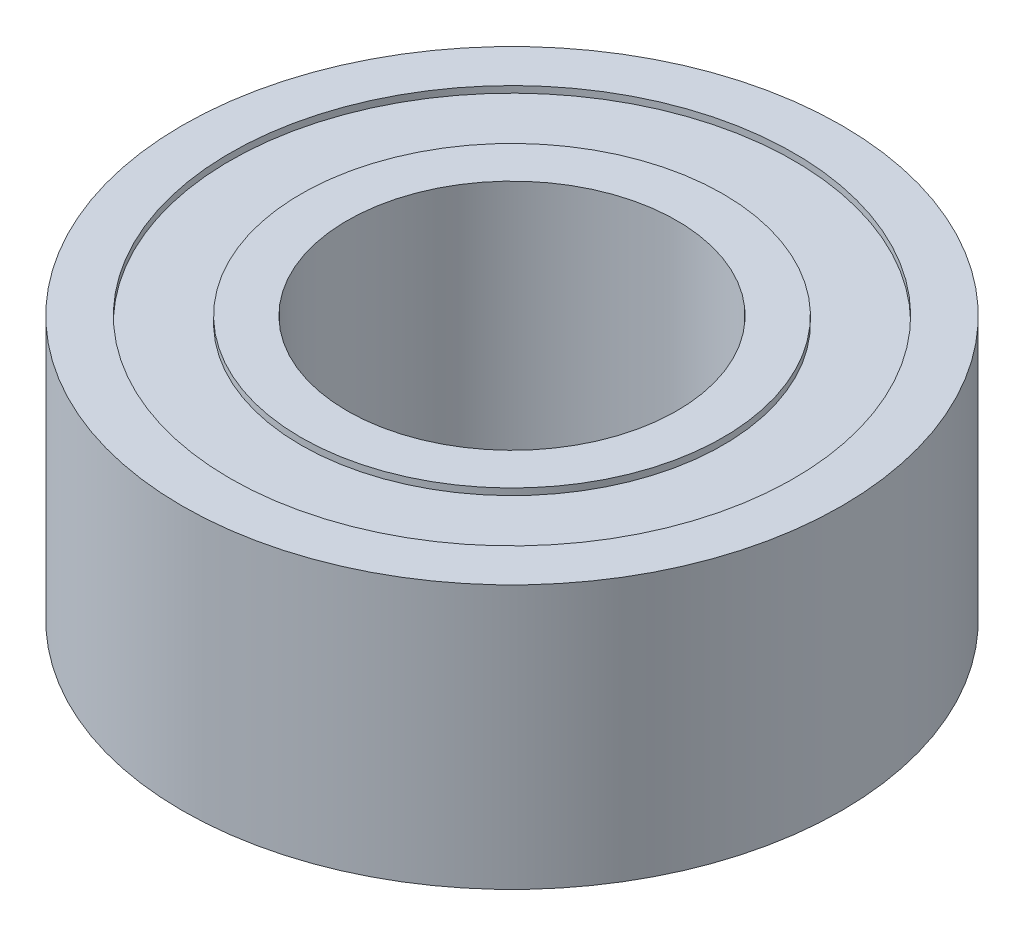
ISO-10303-21;
HEADER;
FILE_DESCRIPTION(('STEP AP214'),'2;1');
FILE_NAME('part.step','',(''),(''),'','','');
FILE_SCHEMA(('AUTOMOTIVE_DESIGN { 1 0 10303 214 1 1 1 1 }'));
ENDSEC;
DATA;
#1=APPLICATION_CONTEXT('core data for automotive mechanical design processes');
#2=APPLICATION_PROTOCOL_DEFINITION('international standard','automotive_design',2000,#1);
#3=PRODUCT_CONTEXT('',#1,'mechanical');
#4=PRODUCT('Part','Part','',(#3));
#5=PRODUCT_RELATED_PRODUCT_CATEGORY('part','',(#4));
#6=PRODUCT_DEFINITION_FORMATION('','',#4);
#7=PRODUCT_DEFINITION_CONTEXT('part definition',#1,'design');
#8=PRODUCT_DEFINITION('design','',#6,#7);
#9=PRODUCT_DEFINITION_SHAPE('','',#8);
#10=(LENGTH_UNIT() NAMED_UNIT(*) SI_UNIT(.MILLI.,.METRE.));
#11=(NAMED_UNIT(*) PLANE_ANGLE_UNIT() SI_UNIT($,.RADIAN.));
#12=(NAMED_UNIT(*) SI_UNIT($,.STERADIAN.) SOLID_ANGLE_UNIT());
#13=UNCERTAINTY_MEASURE_WITH_UNIT(LENGTH_MEASURE(1.E-05),#10,'distance_accuracy_value','');
#14=(GEOMETRIC_REPRESENTATION_CONTEXT(3) GLOBAL_UNCERTAINTY_ASSIGNED_CONTEXT((#13)) GLOBAL_UNIT_ASSIGNED_CONTEXT((#10,
#11,#12)) REPRESENTATION_CONTEXT('',''));
#15=CARTESIAN_POINT('',(0.,0.,0.));
#16=DIRECTION('',(0.,0.,1.));
#17=DIRECTION('',(1.,0.,0.));
#18=AXIS2_PLACEMENT_3D('',#15,#16,#17);
#19=CARTESIAN_POINT('',(0.,0.,0.));
#20=DIRECTION('',(0.,1.,0.));
#21=DIRECTION('',(0.,0.,1.));
#22=AXIS2_PLACEMENT_3D('',#19,#20,#21);
#23=PLANE('',#22);
#24=CARTESIAN_POINT('',(0.,0.,0.));
#25=DIRECTION('',(0.,1.,0.));
#26=DIRECTION('',(0.,0.,1.));
#27=AXIS2_PLACEMENT_3D('',#24,#25,#26);
#28=CIRCLE('',#27,2.5);
#29=CARTESIAN_POINT('',(0.,0.,2.5));
#30=VERTEX_POINT('',#29);
#31=EDGE_CURVE('E46',#30,#30,#28,.T.);
#32=ORIENTED_EDGE('',*,*,#31,.T.);
#33=EDGE_LOOP('',(#32));
#34=FACE_BOUND('',#33,.T.);
#35=CARTESIAN_POINT('',(0.,0.,0.));
#36=DIRECTION('',(0.,-1.,0.));
#37=DIRECTION('',(0.,0.,-1.));
#38=AXIS2_PLACEMENT_3D('',#35,#36,#37);
#39=CIRCLE('',#38,3.2);
#40=CARTESIAN_POINT('',(0.,0.,-3.2));
#41=VERTEX_POINT('',#40);
#42=EDGE_CURVE('E70',#41,#41,#39,.T.);
#43=ORIENTED_EDGE('',*,*,#42,.T.);
#44=EDGE_LOOP('',(#43));
#45=FACE_BOUND('',#44,.T.);
#46=ADVANCED_FACE('F33',(#34,#45),#23,.F.);
#47=CARTESIAN_POINT('',(0.,4.,0.));
#48=DIRECTION('',(0.,1.,0.));
#49=DIRECTION('',(0.,0.,1.));
#50=AXIS2_PLACEMENT_3D('',#47,#48,#49);
#51=PLANE('',#50);
#52=CARTESIAN_POINT('',(0.,4.,0.));
#53=DIRECTION('',(0.,1.,0.));
#54=DIRECTION('',(0.,0.,1.));
#55=AXIS2_PLACEMENT_3D('',#52,#53,#54);
#56=CIRCLE('',#55,2.5);
#57=CARTESIAN_POINT('',(0.,4.,2.5));
#58=VERTEX_POINT('',#57);
#59=EDGE_CURVE('E44',#58,#58,#56,.T.);
#60=ORIENTED_EDGE('',*,*,#59,.F.);
#61=EDGE_LOOP('',(#60));
#62=FACE_BOUND('',#61,.T.);
#63=CARTESIAN_POINT('',(0.,4.,0.));
#64=DIRECTION('',(0.,1.,0.));
#65=DIRECTION('',(0.,0.,1.));
#66=AXIS2_PLACEMENT_3D('',#63,#64,#65);
#67=CIRCLE('',#66,3.2);
#68=CARTESIAN_POINT('',(0.,4.,3.2));
#69=VERTEX_POINT('',#68);
#70=EDGE_CURVE('E58',#69,#69,#67,.T.);
#71=ORIENTED_EDGE('',*,*,#70,.T.);
#72=EDGE_LOOP('',(#71));
#73=FACE_BOUND('',#72,.T.);
#74=ADVANCED_FACE('F108',(#62,#73),#51,.T.);
#75=CARTESIAN_POINT('',(0.,4.,0.));
#76=DIRECTION('',(0.,1.,0.));
#77=DIRECTION('',(0.,0.,1.));
#78=AXIS2_PLACEMENT_3D('',#75,#76,#77);
#79=CIRCLE('',#78,4.275);
#80=CARTESIAN_POINT('',(0.,4.,4.275));
#81=VERTEX_POINT('',#80);
#82=EDGE_CURVE('E52',#81,#81,#79,.T.);
#83=ORIENTED_EDGE('',*,*,#82,.F.);
#84=EDGE_LOOP('',(#83));
#85=FACE_BOUND('',#84,.T.);
#86=CARTESIAN_POINT('',(0.,4.,0.));
#87=DIRECTION('',(0.,1.,0.));
#88=DIRECTION('',(0.,0.,1.));
#89=AXIS2_PLACEMENT_3D('',#86,#87,#88);
#90=CIRCLE('',#89,5.);
#91=CARTESIAN_POINT('',(0.,4.,5.));
#92=VERTEX_POINT('',#91);
#93=EDGE_CURVE('E10',#92,#92,#90,.T.);
#94=ORIENTED_EDGE('',*,*,#93,.T.);
#95=EDGE_LOOP('',(#94));
#96=FACE_BOUND('',#95,.T.);
#97=ADVANCED_FACE('F95',(#85,#96),#51,.T.);
#98=CARTESIAN_POINT('',(0.,0.,0.));
#99=DIRECTION('',(0.,-1.,0.));
#100=DIRECTION('',(0.,0.,-1.));
#101=AXIS2_PLACEMENT_3D('',#98,#99,#100);
#102=CIRCLE('',#101,4.275);
#103=CARTESIAN_POINT('',(0.,0.,-4.275));
#104=VERTEX_POINT('',#103);
#105=EDGE_CURVE('E64',#104,#104,#102,.T.);
#106=ORIENTED_EDGE('',*,*,#105,.F.);
#107=EDGE_LOOP('',(#106));
#108=FACE_BOUND('',#107,.T.);
#109=CARTESIAN_POINT('',(0.,0.,0.));
#110=DIRECTION('',(0.,1.,0.));
#111=DIRECTION('',(0.,0.,1.));
#112=AXIS2_PLACEMENT_3D('',#109,#110,#111);
#113=CIRCLE('',#112,5.);
#114=CARTESIAN_POINT('',(0.,0.,5.));
#115=VERTEX_POINT('',#114);
#116=EDGE_CURVE('E37',#115,#115,#113,.T.);
#117=ORIENTED_EDGE('',*,*,#116,.F.);
#118=EDGE_LOOP('',(#117));
#119=FACE_BOUND('',#118,.T.);
#120=ADVANCED_FACE('F92',(#108,#119),#23,.F.);
#121=CARTESIAN_POINT('',(0.,4.,0.));
#122=DIRECTION('',(0.,-1.,0.));
#123=DIRECTION('',(0.,0.,-1.));
#124=AXIS2_PLACEMENT_3D('',#121,#122,#123);
#125=CYLINDRICAL_SURFACE('',#124,5.);
#126=ORIENTED_EDGE('',*,*,#93,.F.);
#127=EDGE_LOOP('',(#126));
#128=FACE_BOUND('',#127,.T.);
#129=ORIENTED_EDGE('',*,*,#116,.T.);
#130=EDGE_LOOP('',(#129));
#131=FACE_BOUND('',#130,.T.);
#132=ADVANCED_FACE('F35',(#128,#131),#125,.T.);
#133=CARTESIAN_POINT('',(0.,4.,0.));
#134=DIRECTION('',(0.,-1.,0.));
#135=DIRECTION('',(0.,0.,-1.));
#136=AXIS2_PLACEMENT_3D('',#133,#134,#135);
#137=CYLINDRICAL_SURFACE('',#136,2.5);
#138=ORIENTED_EDGE('',*,*,#59,.T.);
#139=EDGE_LOOP('',(#138));
#140=FACE_BOUND('',#139,.T.);
#141=ORIENTED_EDGE('',*,*,#31,.F.);
#142=EDGE_LOOP('',(#141));
#143=FACE_BOUND('',#142,.T.);
#144=ADVANCED_FACE('F99',(#140,#143),#137,.F.);
#145=CARTESIAN_POINT('',(0.,3.9,0.));
#146=DIRECTION('',(0.,1.,0.));
#147=DIRECTION('',(0.,0.,1.));
#148=AXIS2_PLACEMENT_3D('',#145,#146,#147);
#149=CYLINDRICAL_SURFACE('',#148,4.275);
#150=CARTESIAN_POINT('',(0.,3.9,0.));
#151=DIRECTION('',(0.,1.,0.));
#152=DIRECTION('',(0.,0.,1.));
#153=AXIS2_PLACEMENT_3D('',#150,#151,#152);
#154=CIRCLE('',#153,4.275);
#155=CARTESIAN_POINT('',(0.,3.9,4.275));
#156=VERTEX_POINT('',#155);
#157=EDGE_CURVE('E49',#156,#156,#154,.T.);
#158=ORIENTED_EDGE('',*,*,#157,.F.);
#159=EDGE_LOOP('',(#158));
#160=FACE_BOUND('',#159,.T.);
#161=ORIENTED_EDGE('',*,*,#82,.T.);
#162=EDGE_LOOP('',(#161));
#163=FACE_BOUND('',#162,.T.);
#164=ADVANCED_FACE('F104',(#160,#163),#149,.F.);
#165=CARTESIAN_POINT('',(0.,3.9,0.));
#166=DIRECTION('',(0.,1.,0.));
#167=DIRECTION('',(0.,0.,1.));
#168=AXIS2_PLACEMENT_3D('',#165,#166,#167);
#169=PLANE('',#168);
#170=CARTESIAN_POINT('',(0.,3.9,0.));
#171=DIRECTION('',(0.,1.,0.));
#172=DIRECTION('',(0.,0.,1.));
#173=AXIS2_PLACEMENT_3D('',#170,#171,#172);
#174=CIRCLE('',#173,3.2);
#175=CARTESIAN_POINT('',(0.,3.9,3.2));
#176=VERTEX_POINT('',#175);
#177=EDGE_CURVE('E55',#176,#176,#174,.T.);
#178=ORIENTED_EDGE('',*,*,#177,.F.);
#179=EDGE_LOOP('',(#178));
#180=FACE_BOUND('',#179,.T.);
#181=ORIENTED_EDGE('',*,*,#157,.T.);
#182=EDGE_LOOP('',(#181));
#183=FACE_BOUND('',#182,.T.);
#184=ADVANCED_FACE('F121',(#180,#183),#169,.T.);
#185=CARTESIAN_POINT('',(0.,3.9,0.));
#186=DIRECTION('',(0.,1.,0.));
#187=DIRECTION('',(0.,0.,1.));
#188=AXIS2_PLACEMENT_3D('',#185,#186,#187);
#189=CYLINDRICAL_SURFACE('',#188,3.2);
#190=ORIENTED_EDGE('',*,*,#177,.T.);
#191=EDGE_LOOP('',(#190));
#192=FACE_BOUND('',#191,.T.);
#193=ORIENTED_EDGE('',*,*,#70,.F.);
#194=EDGE_LOOP('',(#193));
#195=FACE_BOUND('',#194,.T.);
#196=ADVANCED_FACE('F88',(#192,#195),#189,.T.);
#197=CARTESIAN_POINT('',(0.,0.1,0.));
#198=DIRECTION('',(0.,-1.,0.));
#199=DIRECTION('',(0.,0.,-1.));
#200=AXIS2_PLACEMENT_3D('',#197,#198,#199);
#201=CYLINDRICAL_SURFACE('',#200,4.275);
#202=CARTESIAN_POINT('',(0.,0.1,0.));
#203=DIRECTION('',(0.,-1.,0.));
#204=DIRECTION('',(0.,0.,-1.));
#205=AXIS2_PLACEMENT_3D('',#202,#203,#204);
#206=CIRCLE('',#205,4.275);
#207=CARTESIAN_POINT('',(0.,0.1,-4.275));
#208=VERTEX_POINT('',#207);
#209=EDGE_CURVE('E61',#208,#208,#206,.T.);
#210=ORIENTED_EDGE('',*,*,#209,.F.);
#211=EDGE_LOOP('',(#210));
#212=FACE_BOUND('',#211,.T.);
#213=ORIENTED_EDGE('',*,*,#105,.T.);
#214=EDGE_LOOP('',(#213));
#215=FACE_BOUND('',#214,.T.);
#216=ADVANCED_FACE('F82',(#212,#215),#201,.F.);
#217=CARTESIAN_POINT('',(0.,0.1,0.));
#218=DIRECTION('',(0.,-1.,0.));
#219=DIRECTION('',(0.,0.,-1.));
#220=AXIS2_PLACEMENT_3D('',#217,#218,#219);
#221=PLANE('',#220);
#222=CARTESIAN_POINT('',(0.,0.1,0.));
#223=DIRECTION('',(0.,-1.,0.));
#224=DIRECTION('',(0.,0.,-1.));
#225=AXIS2_PLACEMENT_3D('',#222,#223,#224);
#226=CIRCLE('',#225,3.2);
#227=CARTESIAN_POINT('',(0.,0.1,-3.2));
#228=VERTEX_POINT('',#227);
#229=EDGE_CURVE('E67',#228,#228,#226,.T.);
#230=ORIENTED_EDGE('',*,*,#229,.F.);
#231=EDGE_LOOP('',(#230));
#232=FACE_BOUND('',#231,.T.);
#233=ORIENTED_EDGE('',*,*,#209,.T.);
#234=EDGE_LOOP('',(#233));
#235=FACE_BOUND('',#234,.T.);
#236=ADVANCED_FACE('F79',(#232,#235),#221,.T.);
#237=CARTESIAN_POINT('',(0.,0.1,0.));
#238=DIRECTION('',(0.,-1.,0.));
#239=DIRECTION('',(0.,0.,-1.));
#240=AXIS2_PLACEMENT_3D('',#237,#238,#239);
#241=CYLINDRICAL_SURFACE('',#240,3.2);
#242=ORIENTED_EDGE('',*,*,#229,.T.);
#243=EDGE_LOOP('',(#242));
#244=FACE_BOUND('',#243,.T.);
#245=ORIENTED_EDGE('',*,*,#42,.F.);
#246=EDGE_LOOP('',(#245));
#247=FACE_BOUND('',#246,.T.);
#248=ADVANCED_FACE('F76',(#244,#247),#241,.T.);
#249=CLOSED_SHELL('',(#46,#74,#97,#120,#132,#144,#164,#184,#196,#216,#236,#248));
#250=MANIFOLD_SOLID_BREP('B2',#249);
#251=ADVANCED_BREP_SHAPE_REPRESENTATION('',(#18,#250),#14);
#252=SHAPE_DEFINITION_REPRESENTATION(#9,#251);
ENDSEC;
END-ISO-10303-21;
